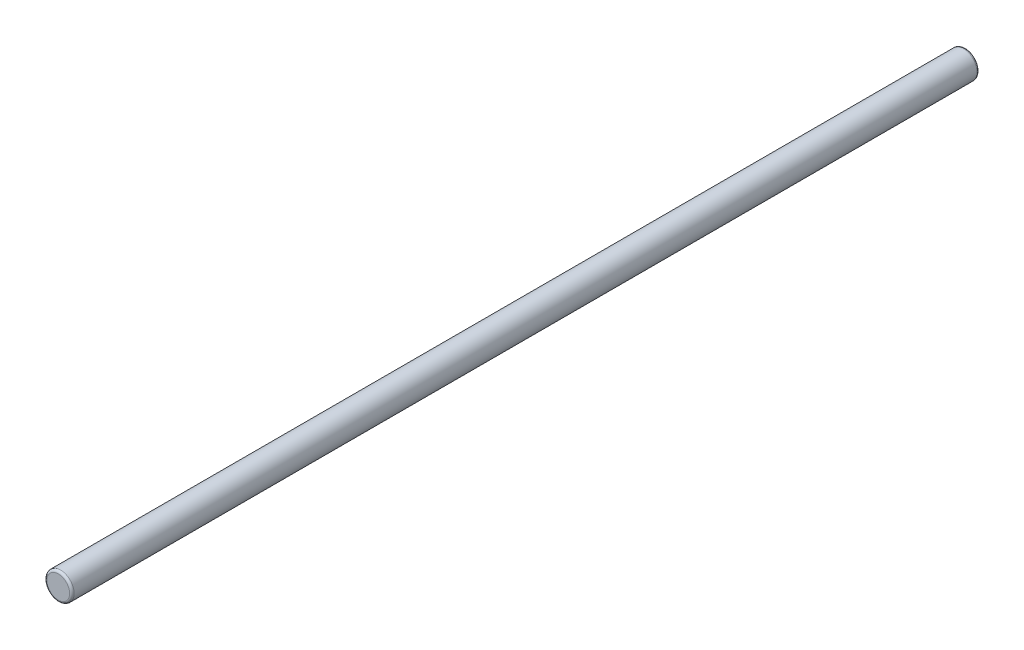
ISO-10303-21;
HEADER;
FILE_DESCRIPTION(('STEP AP214'),'2;1');
FILE_NAME('part.step','',(''),(''),'','','');
FILE_SCHEMA(('AUTOMOTIVE_DESIGN { 1 0 10303 214 1 1 1 1 }'));
ENDSEC;
DATA;
#1=APPLICATION_CONTEXT('core data for automotive mechanical design processes');
#2=APPLICATION_PROTOCOL_DEFINITION('international standard','automotive_design',2000,#1);
#3=PRODUCT_CONTEXT('',#1,'mechanical');
#4=PRODUCT('Part','Part','',(#3));
#5=PRODUCT_RELATED_PRODUCT_CATEGORY('part','',(#4));
#6=PRODUCT_DEFINITION_FORMATION('','',#4);
#7=PRODUCT_DEFINITION_CONTEXT('part definition',#1,'design');
#8=PRODUCT_DEFINITION('design','',#6,#7);
#9=PRODUCT_DEFINITION_SHAPE('','',#8);
#10=(LENGTH_UNIT() NAMED_UNIT(*) SI_UNIT(.MILLI.,.METRE.));
#11=(NAMED_UNIT(*) PLANE_ANGLE_UNIT() SI_UNIT($,.RADIAN.));
#12=(NAMED_UNIT(*) SI_UNIT($,.STERADIAN.) SOLID_ANGLE_UNIT());
#13=UNCERTAINTY_MEASURE_WITH_UNIT(LENGTH_MEASURE(1.E-05),#10,'distance_accuracy_value','');
#14=(GEOMETRIC_REPRESENTATION_CONTEXT(3) GLOBAL_UNCERTAINTY_ASSIGNED_CONTEXT((#13)) GLOBAL_UNIT_ASSIGNED_CONTEXT((#10,
#11,#12)) REPRESENTATION_CONTEXT('',''));
#15=CARTESIAN_POINT('',(0.,0.,0.));
#16=DIRECTION('',(0.,0.,1.));
#17=DIRECTION('',(1.,0.,0.));
#18=AXIS2_PLACEMENT_3D('',#15,#16,#17);
#19=CARTESIAN_POINT('',(0.,0.,100.));
#20=DIRECTION('',(0.,0.,-1.));
#21=DIRECTION('',(-1.,0.,0.));
#22=AXIS2_PLACEMENT_3D('',#19,#20,#21);
#23=CYLINDRICAL_SURFACE('',#22,1.5);
#24=CARTESIAN_POINT('',(0.,0.,0.25));
#25=DIRECTION('',(0.,0.,1.));
#26=DIRECTION('',(1.,0.,0.));
#27=AXIS2_PLACEMENT_3D('',#24,#25,#26);
#28=CIRCLE('',#27,1.5);
#29=CARTESIAN_POINT('',(1.5,0.,0.25));
#30=VERTEX_POINT('',#29);
#31=EDGE_CURVE('E44',#30,#30,#28,.T.);
#32=ORIENTED_EDGE('',*,*,#31,.T.);
#33=EDGE_LOOP('',(#32));
#34=FACE_BOUND('',#33,.T.);
#35=CARTESIAN_POINT('',(0.,0.,99.75));
#36=DIRECTION('',(0.,0.,1.));
#37=DIRECTION('',(1.,0.,0.));
#38=AXIS2_PLACEMENT_3D('',#35,#36,#37);
#39=CIRCLE('',#38,1.5);
#40=CARTESIAN_POINT('',(1.5,0.,99.75));
#41=VERTEX_POINT('',#40);
#42=EDGE_CURVE('E48',#41,#41,#39,.F.);
#43=ORIENTED_EDGE('',*,*,#42,.T.);
#44=EDGE_LOOP('',(#43));
#45=FACE_BOUND('',#44,.T.);
#46=ADVANCED_FACE('F33',(#34,#45),#23,.T.);
#47=CARTESIAN_POINT('',(0.,0.,100.));
#48=DIRECTION('',(0.,0.,1.));
#49=DIRECTION('',(1.,0.,0.));
#50=AXIS2_PLACEMENT_3D('',#47,#48,#49);
#51=PLANE('',#50);
#52=CARTESIAN_POINT('',(0.,0.,100.));
#53=DIRECTION('',(0.,0.,1.));
#54=DIRECTION('',(1.,0.,0.));
#55=AXIS2_PLACEMENT_3D('',#52,#53,#54);
#56=CIRCLE('',#55,1.25);
#57=CARTESIAN_POINT('',(1.25,0.,100.));
#58=VERTEX_POINT('',#57);
#59=EDGE_CURVE('E10',#58,#58,#56,.T.);
#60=ORIENTED_EDGE('',*,*,#59,.T.);
#61=EDGE_LOOP('',(#60));
#62=FACE_BOUND('',#61,.T.);
#63=ADVANCED_FACE('F64',(#62),#51,.T.);
#64=CARTESIAN_POINT('',(0.,0.,0.));
#65=DIRECTION('',(0.,0.,1.));
#66=DIRECTION('',(1.,0.,0.));
#67=AXIS2_PLACEMENT_3D('',#64,#65,#66);
#68=PLANE('',#67);
#69=CARTESIAN_POINT('',(0.,0.,0.));
#70=DIRECTION('',(0.,0.,1.));
#71=DIRECTION('',(1.,0.,0.));
#72=AXIS2_PLACEMENT_3D('',#69,#70,#71);
#73=CIRCLE('',#72,1.25);
#74=CARTESIAN_POINT('',(1.25,0.,0.));
#75=VERTEX_POINT('',#74);
#76=EDGE_CURVE('E40',#75,#75,#73,.F.);
#77=ORIENTED_EDGE('',*,*,#76,.T.);
#78=EDGE_LOOP('',(#77));
#79=FACE_BOUND('',#78,.T.);
#80=ADVANCED_FACE('F61',(#79),#68,.F.);
#81=CARTESIAN_POINT('',(0.,0.,0.25));
#82=DIRECTION('',(0.,0.,1.));
#83=DIRECTION('',(1.,0.,0.));
#84=AXIS2_PLACEMENT_3D('',#81,#82,#83);
#85=TOROIDAL_SURFACE('',#84,1.25,0.25);
#86=ORIENTED_EDGE('',*,*,#76,.F.);
#87=EDGE_LOOP('',(#86));
#88=FACE_BOUND('',#87,.T.);
#89=ORIENTED_EDGE('',*,*,#31,.F.);
#90=EDGE_LOOP('',(#89));
#91=FACE_BOUND('',#90,.T.);
#92=ADVANCED_FACE('F57',(#88,#91),#85,.T.);
#93=CARTESIAN_POINT('',(0.,0.,99.75));
#94=DIRECTION('',(0.,0.,1.));
#95=DIRECTION('',(1.,0.,0.));
#96=AXIS2_PLACEMENT_3D('',#93,#94,#95);
#97=TOROIDAL_SURFACE('',#96,1.25,0.25);
#98=ORIENTED_EDGE('',*,*,#42,.F.);
#99=EDGE_LOOP('',(#98));
#100=FACE_BOUND('',#99,.T.);
#101=ORIENTED_EDGE('',*,*,#59,.F.);
#102=EDGE_LOOP('',(#101));
#103=FACE_BOUND('',#102,.T.);
#104=ADVANCED_FACE('F35',(#100,#103),#97,.T.);
#105=CLOSED_SHELL('',(#46,#63,#80,#92,#104));
#106=MANIFOLD_SOLID_BREP('B2',#105);
#107=ADVANCED_BREP_SHAPE_REPRESENTATION('',(#18,#106),#14);
#108=SHAPE_DEFINITION_REPRESENTATION(#9,#107);
ENDSEC;
END-ISO-10303-21;
